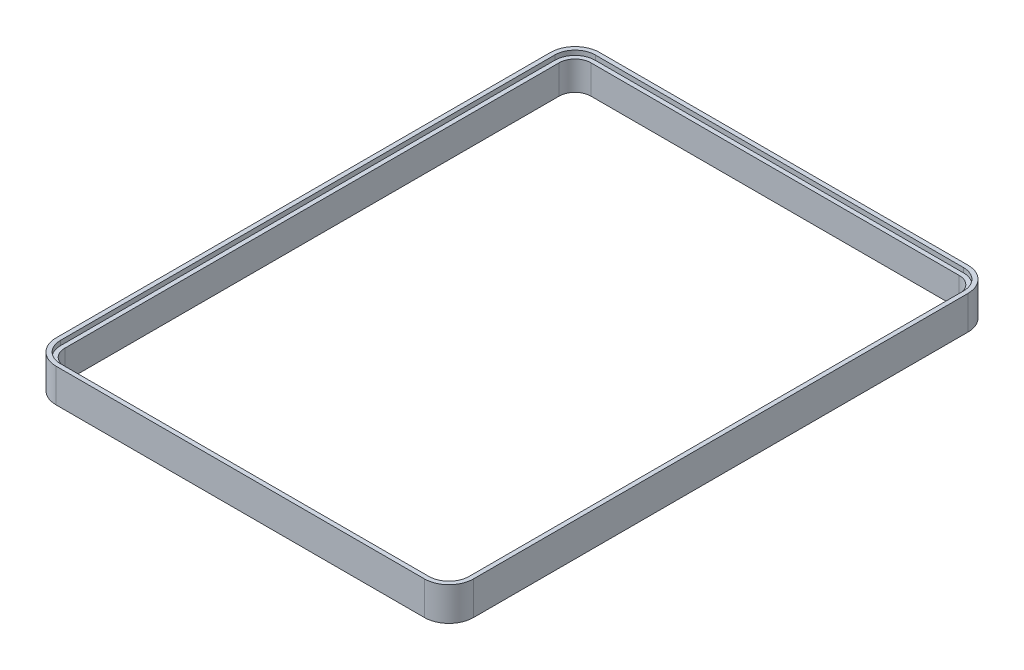
ISO-10303-21;
HEADER;
FILE_DESCRIPTION(('STEP AP214'),'2;1');
FILE_NAME('part.step','',(''),(''),'','','');
FILE_SCHEMA(('AUTOMOTIVE_DESIGN { 1 0 10303 214 1 1 1 1 }'));
ENDSEC;
DATA;
#1=APPLICATION_CONTEXT('core data for automotive mechanical design processes');
#2=APPLICATION_PROTOCOL_DEFINITION('international standard','automotive_design',2000,#1);
#3=PRODUCT_CONTEXT('',#1,'mechanical');
#4=PRODUCT('Part','Part','',(#3));
#5=PRODUCT_RELATED_PRODUCT_CATEGORY('part','',(#4));
#6=PRODUCT_DEFINITION_FORMATION('','',#4);
#7=PRODUCT_DEFINITION_CONTEXT('part definition',#1,'design');
#8=PRODUCT_DEFINITION('design','',#6,#7);
#9=PRODUCT_DEFINITION_SHAPE('','',#8);
#10=(LENGTH_UNIT() NAMED_UNIT(*) SI_UNIT(.MILLI.,.METRE.));
#11=(NAMED_UNIT(*) PLANE_ANGLE_UNIT() SI_UNIT($,.RADIAN.));
#12=(NAMED_UNIT(*) SI_UNIT($,.STERADIAN.) SOLID_ANGLE_UNIT());
#13=UNCERTAINTY_MEASURE_WITH_UNIT(LENGTH_MEASURE(1.E-05),#10,'distance_accuracy_value','');
#14=(GEOMETRIC_REPRESENTATION_CONTEXT(3) GLOBAL_UNCERTAINTY_ASSIGNED_CONTEXT((#13)) GLOBAL_UNIT_ASSIGNED_CONTEXT((#10,
#11,#12)) REPRESENTATION_CONTEXT('',''));
#15=CARTESIAN_POINT('',(0.,0.,0.));
#16=DIRECTION('',(0.,0.,1.));
#17=DIRECTION('',(1.,0.,0.));
#18=AXIS2_PLACEMENT_3D('',#15,#16,#17);
#19=CARTESIAN_POINT('',(31.85,-0.8,-42.75));
#20=DIRECTION('',(0.,1.,0.));
#21=DIRECTION('',(0.,0.,1.));
#22=AXIS2_PLACEMENT_3D('',#19,#20,#21);
#23=CYLINDRICAL_SURFACE('',#22,4.25000000000002);
#24=CARTESIAN_POINT('',(31.85,0.,-42.75));
#25=DIRECTION('',(0.,1.,0.));
#26=DIRECTION('',(0.,0.,1.));
#27=AXIS2_PLACEMENT_3D('',#24,#25,#26);
#28=CIRCLE('',#27,4.25000000000002);
#29=CARTESIAN_POINT('',(36.1,0.,-42.75));
#30=VERTEX_POINT('',#29);
#31=CARTESIAN_POINT('',(31.85,0.,-47.));
#32=VERTEX_POINT('',#31);
#33=EDGE_CURVE('E335',#30,#32,#28,.T.);
#34=ORIENTED_EDGE('',*,*,#33,.F.);
#35=DIRECTION('',(0.,1.,0.));
#36=VECTOR('',#35,1.);
#37=CARTESIAN_POINT('',(36.1,-0.8,-42.75));
#38=LINE('',#37,#36);
#39=CARTESIAN_POINT('',(36.1,-5.8,-42.75));
#40=VERTEX_POINT('',#39);
#41=EDGE_CURVE('E11',#40,#30,#38,.T.);
#42=ORIENTED_EDGE('',*,*,#41,.F.);
#43=CARTESIAN_POINT('',(31.85,-5.8,-42.75));
#44=DIRECTION('',(0.,-1.,0.));
#45=DIRECTION('',(0.,0.,-1.));
#46=AXIS2_PLACEMENT_3D('',#43,#44,#45);
#47=CIRCLE('',#46,4.25000000000002);
#48=CARTESIAN_POINT('',(31.85,-5.8,-47.));
#49=VERTEX_POINT('',#48);
#50=EDGE_CURVE('E282',#49,#40,#47,.T.);
#51=ORIENTED_EDGE('',*,*,#50,.F.);
#52=DIRECTION('',(0.,1.,0.));
#53=VECTOR('',#52,1.);
#54=CARTESIAN_POINT('',(31.85,-0.8,-47.));
#55=LINE('',#54,#53);
#56=EDGE_CURVE('E35',#49,#32,#55,.T.);
#57=ORIENTED_EDGE('',*,*,#56,.T.);
#58=EDGE_LOOP('',(#34,#42,#51,#57));
#59=FACE_BOUND('',#58,.T.);
#60=ADVANCED_FACE('F32',(#59),#23,.T.);
#61=CARTESIAN_POINT('',(36.1,-0.8,42.75));
#62=DIRECTION('',(1.,0.,0.));
#63=DIRECTION('',(0.,0.,-1.));
#64=AXIS2_PLACEMENT_3D('',#61,#62,#63);
#65=PLANE('',#64);
#66=DIRECTION('',(0.,0.,-1.));
#67=VECTOR('',#66,1.);
#68=CARTESIAN_POINT('',(36.1,0.,42.75));
#69=LINE('',#68,#67);
#70=CARTESIAN_POINT('',(36.1,0.,42.75));
#71=VERTEX_POINT('',#70);
#72=EDGE_CURVE('E369',#71,#30,#69,.T.);
#73=ORIENTED_EDGE('',*,*,#72,.F.);
#74=DIRECTION('',(0.,1.,0.));
#75=VECTOR('',#74,1.);
#76=CARTESIAN_POINT('',(36.1,-0.8,42.75));
#77=LINE('',#76,#75);
#78=CARTESIAN_POINT('',(36.1,-5.8,42.75));
#79=VERTEX_POINT('',#78);
#80=EDGE_CURVE('E40',#79,#71,#77,.T.);
#81=ORIENTED_EDGE('',*,*,#80,.F.);
#82=DIRECTION('',(0.,0.,1.));
#83=VECTOR('',#82,1.);
#84=CARTESIAN_POINT('',(36.1,-5.8,-42.75));
#85=LINE('',#84,#83);
#86=EDGE_CURVE('E285',#40,#79,#85,.T.);
#87=ORIENTED_EDGE('',*,*,#86,.F.);
#88=ORIENTED_EDGE('',*,*,#41,.T.);
#89=EDGE_LOOP('',(#73,#81,#87,#88));
#90=FACE_BOUND('',#89,.T.);
#91=ADVANCED_FACE('F394',(#90),#65,.T.);
#92=CARTESIAN_POINT('',(31.85,-0.8,42.75));
#93=DIRECTION('',(0.,1.,0.));
#94=DIRECTION('',(0.,0.,1.));
#95=AXIS2_PLACEMENT_3D('',#92,#93,#94);
#96=CYLINDRICAL_SURFACE('',#95,4.25000000000002);
#97=CARTESIAN_POINT('',(31.85,0.,42.75));
#98=DIRECTION('',(0.,1.,0.));
#99=DIRECTION('',(0.,0.,-1.));
#100=AXIS2_PLACEMENT_3D('',#97,#98,#99);
#101=CIRCLE('',#100,4.25000000000002);
#102=CARTESIAN_POINT('',(31.85,0.,47.));
#103=VERTEX_POINT('',#102);
#104=EDGE_CURVE('E366',#103,#71,#101,.T.);
#105=ORIENTED_EDGE('',*,*,#104,.F.);
#106=DIRECTION('',(0.,1.,0.));
#107=VECTOR('',#106,1.);
#108=CARTESIAN_POINT('',(31.85,-0.8,47.));
#109=LINE('',#108,#107);
#110=CARTESIAN_POINT('',(31.85,-5.8,47.));
#111=VERTEX_POINT('',#110);
#112=EDGE_CURVE('E373',#111,#103,#109,.T.);
#113=ORIENTED_EDGE('',*,*,#112,.F.);
#114=CARTESIAN_POINT('',(31.85,-5.8,42.75));
#115=DIRECTION('',(0.,-1.,0.));
#116=DIRECTION('',(0.,0.,-1.));
#117=AXIS2_PLACEMENT_3D('',#114,#115,#116);
#118=CIRCLE('',#117,4.25000000000001);
#119=EDGE_CURVE('E212',#79,#111,#118,.T.);
#120=ORIENTED_EDGE('',*,*,#119,.F.);
#121=ORIENTED_EDGE('',*,*,#80,.T.);
#122=EDGE_LOOP('',(#105,#113,#120,#121));
#123=FACE_BOUND('',#122,.T.);
#124=ADVANCED_FACE('F414',(#123),#96,.T.);
#125=CARTESIAN_POINT('',(31.85,-0.8,47.));
#126=DIRECTION('',(0.,0.,1.));
#127=DIRECTION('',(1.,0.,0.));
#128=AXIS2_PLACEMENT_3D('',#125,#126,#127);
#129=PLANE('',#128);
#130=DIRECTION('',(1.,0.,0.));
#131=VECTOR('',#130,1.);
#132=CARTESIAN_POINT('',(31.85,0.,47.));
#133=LINE('',#132,#131);
#134=CARTESIAN_POINT('',(-31.85,0.,47.));
#135=VERTEX_POINT('',#134);
#136=EDGE_CURVE('E363',#135,#103,#133,.T.);
#137=ORIENTED_EDGE('',*,*,#136,.F.);
#138=DIRECTION('',(0.,1.,0.));
#139=VECTOR('',#138,1.);
#140=CARTESIAN_POINT('',(-31.85,-0.8,47.));
#141=LINE('',#140,#139);
#142=CARTESIAN_POINT('',(-31.85,-5.8,47.));
#143=VERTEX_POINT('',#142);
#144=EDGE_CURVE('E375',#143,#135,#141,.T.);
#145=ORIENTED_EDGE('',*,*,#144,.F.);
#146=DIRECTION('',(-1.,0.,0.));
#147=VECTOR('',#146,1.);
#148=CARTESIAN_POINT('',(31.85,-5.8,47.));
#149=LINE('',#148,#147);
#150=EDGE_CURVE('E267',#111,#143,#149,.T.);
#151=ORIENTED_EDGE('',*,*,#150,.F.);
#152=ORIENTED_EDGE('',*,*,#112,.T.);
#153=EDGE_LOOP('',(#137,#145,#151,#152));
#154=FACE_BOUND('',#153,.T.);
#155=ADVANCED_FACE('F412',(#154),#129,.T.);
#156=CARTESIAN_POINT('',(-31.85,-0.8,42.75));
#157=DIRECTION('',(0.,1.,0.));
#158=DIRECTION('',(0.,0.,1.));
#159=AXIS2_PLACEMENT_3D('',#156,#157,#158);
#160=CYLINDRICAL_SURFACE('',#159,4.25000000000003);
#161=CARTESIAN_POINT('',(-31.85,0.,42.75));
#162=DIRECTION('',(0.,1.,0.));
#163=DIRECTION('',(0.,0.,1.));
#164=AXIS2_PLACEMENT_3D('',#161,#162,#163);
#165=CIRCLE('',#164,4.25000000000003);
#166=CARTESIAN_POINT('',(-36.1,0.,42.75));
#167=VERTEX_POINT('',#166);
#168=EDGE_CURVE('E360',#167,#135,#165,.T.);
#169=ORIENTED_EDGE('',*,*,#168,.F.);
#170=DIRECTION('',(0.,1.,0.));
#171=VECTOR('',#170,1.);
#172=CARTESIAN_POINT('',(-36.1,-0.8,42.75));
#173=LINE('',#172,#171);
#174=CARTESIAN_POINT('',(-36.1,-5.8,42.75));
#175=VERTEX_POINT('',#174);
#176=EDGE_CURVE('E377',#175,#167,#173,.T.);
#177=ORIENTED_EDGE('',*,*,#176,.F.);
#178=CARTESIAN_POINT('',(-31.85,-5.8,42.75));
#179=DIRECTION('',(0.,-1.,0.));
#180=DIRECTION('',(0.,0.,-1.));
#181=AXIS2_PLACEMENT_3D('',#178,#179,#180);
#182=CIRCLE('',#181,4.25000000000003);
#183=EDGE_CURVE('E270',#143,#175,#182,.T.);
#184=ORIENTED_EDGE('',*,*,#183,.F.);
#185=ORIENTED_EDGE('',*,*,#144,.T.);
#186=EDGE_LOOP('',(#169,#177,#184,#185));
#187=FACE_BOUND('',#186,.T.);
#188=ADVANCED_FACE('F408',(#187),#160,.T.);
#189=CARTESIAN_POINT('',(-36.1,-0.8,42.75));
#190=DIRECTION('',(-1.,0.,0.));
#191=DIRECTION('',(0.,0.,1.));
#192=AXIS2_PLACEMENT_3D('',#189,#190,#191);
#193=PLANE('',#192);
#194=DIRECTION('',(0.,0.,1.));
#195=VECTOR('',#194,1.);
#196=CARTESIAN_POINT('',(-36.1,0.,42.75));
#197=LINE('',#196,#195);
#198=CARTESIAN_POINT('',(-36.1,0.,-42.75));
#199=VERTEX_POINT('',#198);
#200=EDGE_CURVE('E357',#199,#167,#197,.T.);
#201=ORIENTED_EDGE('',*,*,#200,.F.);
#202=DIRECTION('',(0.,1.,0.));
#203=VECTOR('',#202,1.);
#204=CARTESIAN_POINT('',(-36.1,-0.8,-42.75));
#205=LINE('',#204,#203);
#206=CARTESIAN_POINT('',(-36.1,-5.8,-42.75));
#207=VERTEX_POINT('',#206);
#208=EDGE_CURVE('E379',#207,#199,#205,.T.);
#209=ORIENTED_EDGE('',*,*,#208,.F.);
#210=DIRECTION('',(0.,0.,-1.));
#211=VECTOR('',#210,1.);
#212=CARTESIAN_POINT('',(-36.1,-5.8,42.75));
#213=LINE('',#212,#211);
#214=EDGE_CURVE('E273',#175,#207,#213,.T.);
#215=ORIENTED_EDGE('',*,*,#214,.F.);
#216=ORIENTED_EDGE('',*,*,#176,.T.);
#217=EDGE_LOOP('',(#201,#209,#215,#216));
#218=FACE_BOUND('',#217,.T.);
#219=ADVANCED_FACE('F405',(#218),#193,.T.);
#220=CARTESIAN_POINT('',(-31.85,-0.8,-42.75));
#221=DIRECTION('',(0.,1.,0.));
#222=DIRECTION('',(0.,0.,1.));
#223=AXIS2_PLACEMENT_3D('',#220,#221,#222);
#224=CYLINDRICAL_SURFACE('',#223,4.25000000000002);
#225=CARTESIAN_POINT('',(-31.85,0.,-42.75));
#226=DIRECTION('',(0.,1.,0.));
#227=DIRECTION('',(0.,0.,-1.));
#228=AXIS2_PLACEMENT_3D('',#225,#226,#227);
#229=CIRCLE('',#228,4.25000000000002);
#230=CARTESIAN_POINT('',(-31.85,0.,-47.));
#231=VERTEX_POINT('',#230);
#232=EDGE_CURVE('E354',#231,#199,#229,.T.);
#233=ORIENTED_EDGE('',*,*,#232,.F.);
#234=DIRECTION('',(0.,1.,0.));
#235=VECTOR('',#234,1.);
#236=CARTESIAN_POINT('',(-31.85,-0.8,-47.));
#237=LINE('',#236,#235);
#238=CARTESIAN_POINT('',(-31.85,-5.8,-47.));
#239=VERTEX_POINT('',#238);
#240=EDGE_CURVE('E380',#239,#231,#237,.T.);
#241=ORIENTED_EDGE('',*,*,#240,.F.);
#242=CARTESIAN_POINT('',(-31.85,-5.8,-42.75));
#243=DIRECTION('',(0.,-1.,0.));
#244=DIRECTION('',(0.,0.,-1.));
#245=AXIS2_PLACEMENT_3D('',#242,#243,#244);
#246=CIRCLE('',#245,4.25000000000001);
#247=EDGE_CURVE('E276',#207,#239,#246,.T.);
#248=ORIENTED_EDGE('',*,*,#247,.F.);
#249=ORIENTED_EDGE('',*,*,#208,.T.);
#250=EDGE_LOOP('',(#233,#241,#248,#249));
#251=FACE_BOUND('',#250,.T.);
#252=ADVANCED_FACE('F401',(#251),#224,.T.);
#253=CARTESIAN_POINT('',(31.85,-0.8,-47.));
#254=DIRECTION('',(0.,0.,-1.));
#255=DIRECTION('',(-1.,0.,0.));
#256=AXIS2_PLACEMENT_3D('',#253,#254,#255);
#257=PLANE('',#256);
#258=DIRECTION('',(-1.,0.,0.));
#259=VECTOR('',#258,1.);
#260=CARTESIAN_POINT('',(31.85,0.,-47.));
#261=LINE('',#260,#259);
#262=EDGE_CURVE('E351',#32,#231,#261,.T.);
#263=ORIENTED_EDGE('',*,*,#262,.F.);
#264=ORIENTED_EDGE('',*,*,#56,.F.);
#265=DIRECTION('',(1.,0.,0.));
#266=VECTOR('',#265,1.);
#267=CARTESIAN_POINT('',(-31.85,-5.8,-47.));
#268=LINE('',#267,#266);
#269=EDGE_CURVE('E279',#239,#49,#268,.T.);
#270=ORIENTED_EDGE('',*,*,#269,.F.);
#271=ORIENTED_EDGE('',*,*,#240,.T.);
#272=EDGE_LOOP('',(#263,#264,#270,#271));
#273=FACE_BOUND('',#272,.T.);
#274=ADVANCED_FACE('F388',(#273),#257,.T.);
#275=CARTESIAN_POINT('',(31.85,0.,-42.75));
#276=DIRECTION('',(0.,1.,0.));
#277=DIRECTION('',(0.,0.,1.));
#278=AXIS2_PLACEMENT_3D('',#275,#276,#277);
#279=PLANE('',#278);
#280=CARTESIAN_POINT('',(31.85,0.,-42.75));
#281=DIRECTION('',(0.,1.,0.));
#282=DIRECTION('',(0.,0.,1.));
#283=AXIS2_PLACEMENT_3D('',#280,#281,#282);
#284=CIRCLE('',#283,3.50000000000002);
#285=CARTESIAN_POINT('',(35.35,0.,-42.75));
#286=VERTEX_POINT('',#285);
#287=CARTESIAN_POINT('',(31.85,0.,-46.25));
#288=VERTEX_POINT('',#287);
#289=EDGE_CURVE('E56',#286,#288,#284,.T.);
#290=ORIENTED_EDGE('',*,*,#289,.F.);
#291=DIRECTION('',(0.,0.,-1.));
#292=VECTOR('',#291,1.);
#293=CARTESIAN_POINT('',(35.35,0.,42.75));
#294=LINE('',#293,#292);
#295=CARTESIAN_POINT('',(35.35,0.,42.75));
#296=VERTEX_POINT('',#295);
#297=EDGE_CURVE('E292',#296,#286,#294,.T.);
#298=ORIENTED_EDGE('',*,*,#297,.F.);
#299=CARTESIAN_POINT('',(31.85,0.,42.75));
#300=DIRECTION('',(0.,1.,0.));
#301=DIRECTION('',(0.,0.,-1.));
#302=AXIS2_PLACEMENT_3D('',#299,#300,#301);
#303=CIRCLE('',#302,3.50000000000002);
#304=CARTESIAN_POINT('',(31.85,0.,46.25));
#305=VERTEX_POINT('',#304);
#306=EDGE_CURVE('E328',#305,#296,#303,.T.);
#307=ORIENTED_EDGE('',*,*,#306,.F.);
#308=DIRECTION('',(1.,0.,0.));
#309=VECTOR('',#308,1.);
#310=CARTESIAN_POINT('',(31.85,0.,46.25));
#311=LINE('',#310,#309);
#312=CARTESIAN_POINT('',(-31.85,0.,46.25));
#313=VERTEX_POINT('',#312);
#314=EDGE_CURVE('E325',#313,#305,#311,.T.);
#315=ORIENTED_EDGE('',*,*,#314,.F.);
#316=CARTESIAN_POINT('',(-31.85,0.,42.75));
#317=DIRECTION('',(0.,1.,0.));
#318=DIRECTION('',(0.,0.,1.));
#319=AXIS2_PLACEMENT_3D('',#316,#317,#318);
#320=CIRCLE('',#319,3.50000000000002);
#321=CARTESIAN_POINT('',(-35.35,0.,42.75));
#322=VERTEX_POINT('',#321);
#323=EDGE_CURVE('E322',#322,#313,#320,.T.);
#324=ORIENTED_EDGE('',*,*,#323,.F.);
#325=DIRECTION('',(0.,0.,1.));
#326=VECTOR('',#325,1.);
#327=CARTESIAN_POINT('',(-35.35,0.,42.75));
#328=LINE('',#327,#326);
#329=CARTESIAN_POINT('',(-35.35,0.,-42.75));
#330=VERTEX_POINT('',#329);
#331=EDGE_CURVE('E319',#330,#322,#328,.T.);
#332=ORIENTED_EDGE('',*,*,#331,.F.);
#333=CARTESIAN_POINT('',(-31.85,0.,-42.75));
#334=DIRECTION('',(0.,1.,0.));
#335=DIRECTION('',(0.,0.,-1.));
#336=AXIS2_PLACEMENT_3D('',#333,#334,#335);
#337=CIRCLE('',#336,3.50000000000002);
#338=CARTESIAN_POINT('',(-31.85,0.,-46.25));
#339=VERTEX_POINT('',#338);
#340=EDGE_CURVE('E316',#339,#330,#337,.T.);
#341=ORIENTED_EDGE('',*,*,#340,.F.);
#342=DIRECTION('',(-1.,0.,0.));
#343=VECTOR('',#342,1.);
#344=CARTESIAN_POINT('',(31.85,0.,-46.25));
#345=LINE('',#344,#343);
#346=EDGE_CURVE('E313',#288,#339,#345,.T.);
#347=ORIENTED_EDGE('',*,*,#346,.F.);
#348=EDGE_LOOP('',(#290,#298,#307,#315,#324,#332,#341,#347));
#349=FACE_BOUND('',#348,.T.);
#350=ORIENTED_EDGE('',*,*,#33,.T.);
#351=ORIENTED_EDGE('',*,*,#262,.T.);
#352=ORIENTED_EDGE('',*,*,#232,.T.);
#353=ORIENTED_EDGE('',*,*,#200,.T.);
#354=ORIENTED_EDGE('',*,*,#168,.T.);
#355=ORIENTED_EDGE('',*,*,#136,.T.);
#356=ORIENTED_EDGE('',*,*,#104,.T.);
#357=ORIENTED_EDGE('',*,*,#72,.T.);
#358=EDGE_LOOP('',(#350,#351,#352,#353,#354,#355,#356,#357));
#359=FACE_BOUND('',#358,.T.);
#360=ADVANCED_FACE('F390',(#349,#359),#279,.T.);
#361=CARTESIAN_POINT('',(31.85,-0.8,-42.75));
#362=DIRECTION('',(0.,1.,0.));
#363=DIRECTION('',(0.,0.,1.));
#364=AXIS2_PLACEMENT_3D('',#361,#362,#363);
#365=CYLINDRICAL_SURFACE('',#364,3.50000000000002);
#366=ORIENTED_EDGE('',*,*,#289,.T.);
#367=DIRECTION('',(0.,1.,0.));
#368=VECTOR('',#367,1.);
#369=CARTESIAN_POINT('',(31.85,-0.8,-46.25));
#370=LINE('',#369,#368);
#371=CARTESIAN_POINT('',(31.85,-0.8,-46.25));
#372=VERTEX_POINT('',#371);
#373=EDGE_CURVE('E311',#372,#288,#370,.T.);
#374=ORIENTED_EDGE('',*,*,#373,.F.);
#375=CARTESIAN_POINT('',(31.85,-0.8,-42.75));
#376=DIRECTION('',(0.,1.,0.));
#377=DIRECTION('',(0.,0.,1.));
#378=AXIS2_PLACEMENT_3D('',#375,#376,#377);
#379=CIRCLE('',#378,3.50000000000002);
#380=CARTESIAN_POINT('',(35.35,-0.8,-42.75));
#381=VERTEX_POINT('',#380);
#382=EDGE_CURVE('E288',#381,#372,#379,.T.);
#383=ORIENTED_EDGE('',*,*,#382,.F.);
#384=DIRECTION('',(0.,1.,0.));
#385=VECTOR('',#384,1.);
#386=CARTESIAN_POINT('',(35.35,-0.8,-42.75));
#387=LINE('',#386,#385);
#388=EDGE_CURVE('E333',#381,#286,#387,.T.);
#389=ORIENTED_EDGE('',*,*,#388,.T.);
#390=EDGE_LOOP('',(#366,#374,#383,#389));
#391=FACE_BOUND('',#390,.T.);
#392=ADVANCED_FACE('F486',(#391),#365,.F.);
#393=CARTESIAN_POINT('',(35.35,-0.8,42.75));
#394=DIRECTION('',(1.,0.,0.));
#395=DIRECTION('',(0.,0.,-1.));
#396=AXIS2_PLACEMENT_3D('',#393,#394,#395);
#397=PLANE('',#396);
#398=ORIENTED_EDGE('',*,*,#297,.T.);
#399=ORIENTED_EDGE('',*,*,#388,.F.);
#400=DIRECTION('',(0.,0.,-1.));
#401=VECTOR('',#400,1.);
#402=CARTESIAN_POINT('',(35.35,-0.8,42.75));
#403=LINE('',#402,#401);
#404=CARTESIAN_POINT('',(35.35,-0.8,42.75));
#405=VERTEX_POINT('',#404);
#406=EDGE_CURVE('E308',#405,#381,#403,.T.);
#407=ORIENTED_EDGE('',*,*,#406,.F.);
#408=DIRECTION('',(0.,1.,0.));
#409=VECTOR('',#408,1.);
#410=CARTESIAN_POINT('',(35.35,-0.8,42.75));
#411=LINE('',#410,#409);
#412=EDGE_CURVE('E336',#405,#296,#411,.T.);
#413=ORIENTED_EDGE('',*,*,#412,.T.);
#414=EDGE_LOOP('',(#398,#399,#407,#413));
#415=FACE_BOUND('',#414,.T.);
#416=ADVANCED_FACE('F491',(#415),#397,.F.);
#417=CARTESIAN_POINT('',(31.85,-0.8,42.75));
#418=DIRECTION('',(0.,1.,0.));
#419=DIRECTION('',(0.,0.,1.));
#420=AXIS2_PLACEMENT_3D('',#417,#418,#419);
#421=CYLINDRICAL_SURFACE('',#420,3.50000000000002);
#422=ORIENTED_EDGE('',*,*,#306,.T.);
#423=ORIENTED_EDGE('',*,*,#412,.F.);
#424=CARTESIAN_POINT('',(31.85,-0.8,42.75));
#425=DIRECTION('',(0.,1.,0.));
#426=DIRECTION('',(0.,0.,-1.));
#427=AXIS2_PLACEMENT_3D('',#424,#425,#426);
#428=CIRCLE('',#427,3.50000000000002);
#429=CARTESIAN_POINT('',(31.85,-0.8,46.25));
#430=VERTEX_POINT('',#429);
#431=EDGE_CURVE('E305',#430,#405,#428,.T.);
#432=ORIENTED_EDGE('',*,*,#431,.F.);
#433=DIRECTION('',(0.,1.,0.));
#434=VECTOR('',#433,1.);
#435=CARTESIAN_POINT('',(31.85,-0.8,46.25));
#436=LINE('',#435,#434);
#437=EDGE_CURVE('E338',#430,#305,#436,.T.);
#438=ORIENTED_EDGE('',*,*,#437,.T.);
#439=EDGE_LOOP('',(#422,#423,#432,#438));
#440=FACE_BOUND('',#439,.T.);
#441=ADVANCED_FACE('F501',(#440),#421,.F.);
#442=CARTESIAN_POINT('',(31.85,-0.8,46.25));
#443=DIRECTION('',(0.,0.,1.));
#444=DIRECTION('',(1.,0.,0.));
#445=AXIS2_PLACEMENT_3D('',#442,#443,#444);
#446=PLANE('',#445);
#447=ORIENTED_EDGE('',*,*,#314,.T.);
#448=ORIENTED_EDGE('',*,*,#437,.F.);
#449=DIRECTION('',(1.,0.,0.));
#450=VECTOR('',#449,1.);
#451=CARTESIAN_POINT('',(31.85,-0.8,46.25));
#452=LINE('',#451,#450);
#453=CARTESIAN_POINT('',(-31.85,-0.8,46.25));
#454=VERTEX_POINT('',#453);
#455=EDGE_CURVE('E302',#454,#430,#452,.T.);
#456=ORIENTED_EDGE('',*,*,#455,.F.);
#457=DIRECTION('',(0.,1.,0.));
#458=VECTOR('',#457,1.);
#459=CARTESIAN_POINT('',(-31.85,-0.8,46.25));
#460=LINE('',#459,#458);
#461=EDGE_CURVE('E340',#454,#313,#460,.T.);
#462=ORIENTED_EDGE('',*,*,#461,.T.);
#463=EDGE_LOOP('',(#447,#448,#456,#462));
#464=FACE_BOUND('',#463,.T.);
#465=ADVANCED_FACE('F511',(#464),#446,.F.);
#466=CARTESIAN_POINT('',(-31.85,-0.8,42.75));
#467=DIRECTION('',(0.,1.,0.));
#468=DIRECTION('',(0.,0.,1.));
#469=AXIS2_PLACEMENT_3D('',#466,#467,#468);
#470=CYLINDRICAL_SURFACE('',#469,3.50000000000002);
#471=ORIENTED_EDGE('',*,*,#323,.T.);
#472=ORIENTED_EDGE('',*,*,#461,.F.);
#473=CARTESIAN_POINT('',(-31.85,-0.8,42.75));
#474=DIRECTION('',(0.,1.,0.));
#475=DIRECTION('',(0.,0.,1.));
#476=AXIS2_PLACEMENT_3D('',#473,#474,#475);
#477=CIRCLE('',#476,3.50000000000002);
#478=CARTESIAN_POINT('',(-35.35,-0.8,42.75));
#479=VERTEX_POINT('',#478);
#480=EDGE_CURVE('E299',#479,#454,#477,.T.);
#481=ORIENTED_EDGE('',*,*,#480,.F.);
#482=DIRECTION('',(0.,1.,0.));
#483=VECTOR('',#482,1.);
#484=CARTESIAN_POINT('',(-35.35,-0.8,42.75));
#485=LINE('',#484,#483);
#486=EDGE_CURVE('E342',#479,#322,#485,.T.);
#487=ORIENTED_EDGE('',*,*,#486,.T.);
#488=EDGE_LOOP('',(#471,#472,#481,#487));
#489=FACE_BOUND('',#488,.T.);
#490=ADVANCED_FACE('F521',(#489),#470,.F.);
#491=CARTESIAN_POINT('',(-35.35,-0.8,42.75));
#492=DIRECTION('',(-1.,0.,0.));
#493=DIRECTION('',(0.,0.,1.));
#494=AXIS2_PLACEMENT_3D('',#491,#492,#493);
#495=PLANE('',#494);
#496=ORIENTED_EDGE('',*,*,#331,.T.);
#497=ORIENTED_EDGE('',*,*,#486,.F.);
#498=DIRECTION('',(0.,0.,1.));
#499=VECTOR('',#498,1.);
#500=CARTESIAN_POINT('',(-35.35,-0.8,42.75));
#501=LINE('',#500,#499);
#502=CARTESIAN_POINT('',(-35.35,-0.8,-42.75));
#503=VERTEX_POINT('',#502);
#504=EDGE_CURVE('E296',#503,#479,#501,.T.);
#505=ORIENTED_EDGE('',*,*,#504,.F.);
#506=DIRECTION('',(0.,1.,0.));
#507=VECTOR('',#506,1.);
#508=CARTESIAN_POINT('',(-35.35,-0.8,-42.75));
#509=LINE('',#508,#507);
#510=EDGE_CURVE('E344',#503,#330,#509,.T.);
#511=ORIENTED_EDGE('',*,*,#510,.T.);
#512=EDGE_LOOP('',(#496,#497,#505,#511));
#513=FACE_BOUND('',#512,.T.);
#514=ADVANCED_FACE('F531',(#513),#495,.F.);
#515=CARTESIAN_POINT('',(-31.85,-0.8,-42.75));
#516=DIRECTION('',(0.,1.,0.));
#517=DIRECTION('',(0.,0.,1.));
#518=AXIS2_PLACEMENT_3D('',#515,#516,#517);
#519=CYLINDRICAL_SURFACE('',#518,3.50000000000002);
#520=ORIENTED_EDGE('',*,*,#340,.T.);
#521=ORIENTED_EDGE('',*,*,#510,.F.);
#522=CARTESIAN_POINT('',(-31.85,-0.8,-42.75));
#523=DIRECTION('',(0.,1.,0.));
#524=DIRECTION('',(0.,0.,-1.));
#525=AXIS2_PLACEMENT_3D('',#522,#523,#524);
#526=CIRCLE('',#525,3.50000000000002);
#527=CARTESIAN_POINT('',(-31.85,-0.8,-46.25));
#528=VERTEX_POINT('',#527);
#529=EDGE_CURVE('E48',#528,#503,#526,.T.);
#530=ORIENTED_EDGE('',*,*,#529,.F.);
#531=DIRECTION('',(0.,1.,0.));
#532=VECTOR('',#531,1.);
#533=CARTESIAN_POINT('',(-31.85,-0.8,-46.25));
#534=LINE('',#533,#532);
#535=EDGE_CURVE('E346',#528,#339,#534,.T.);
#536=ORIENTED_EDGE('',*,*,#535,.T.);
#537=EDGE_LOOP('',(#520,#521,#530,#536));
#538=FACE_BOUND('',#537,.T.);
#539=ADVANCED_FACE('F541',(#538),#519,.F.);
#540=CARTESIAN_POINT('',(31.85,-0.8,-46.25));
#541=DIRECTION('',(0.,0.,-1.));
#542=DIRECTION('',(-1.,0.,0.));
#543=AXIS2_PLACEMENT_3D('',#540,#541,#542);
#544=PLANE('',#543);
#545=ORIENTED_EDGE('',*,*,#346,.T.);
#546=ORIENTED_EDGE('',*,*,#535,.F.);
#547=DIRECTION('',(-1.,0.,0.));
#548=VECTOR('',#547,1.);
#549=CARTESIAN_POINT('',(31.85,-0.8,-46.25));
#550=LINE('',#549,#548);
#551=EDGE_CURVE('E291',#372,#528,#550,.T.);
#552=ORIENTED_EDGE('',*,*,#551,.F.);
#553=ORIENTED_EDGE('',*,*,#373,.T.);
#554=EDGE_LOOP('',(#545,#546,#552,#553));
#555=FACE_BOUND('',#554,.T.);
#556=ADVANCED_FACE('F551',(#555),#544,.F.);
#557=CARTESIAN_POINT('',(31.85,-0.8,42.75));
#558=DIRECTION('',(0.,-1.,0.));
#559=DIRECTION('',(0.,0.,-1.));
#560=AXIS2_PLACEMENT_3D('',#557,#558,#559);
#561=PLANE('',#560);
#562=CARTESIAN_POINT('',(-31.85,-0.8,42.75));
#563=DIRECTION('',(0.,-1.,0.));
#564=DIRECTION('',(0.,0.,-1.));
#565=AXIS2_PLACEMENT_3D('',#562,#563,#564);
#566=CIRCLE('',#565,2.75000000000004);
#567=CARTESIAN_POINT('',(-31.85,-0.8,45.5));
#568=VERTEX_POINT('',#567);
#569=CARTESIAN_POINT('',(-34.6,-0.8,42.75));
#570=VERTEX_POINT('',#569);
#571=EDGE_CURVE('E233',#568,#570,#566,.T.);
#572=ORIENTED_EDGE('',*,*,#571,.T.);
#573=DIRECTION('',(0.,0.,-1.));
#574=VECTOR('',#573,1.);
#575=CARTESIAN_POINT('',(-34.6,-0.8,42.75));
#576=LINE('',#575,#574);
#577=CARTESIAN_POINT('',(-34.6,-0.8,-42.75));
#578=VERTEX_POINT('',#577);
#579=EDGE_CURVE('E211',#570,#578,#576,.T.);
#580=ORIENTED_EDGE('',*,*,#579,.T.);
#581=CARTESIAN_POINT('',(-31.85,-0.8,-42.75));
#582=DIRECTION('',(0.,-1.,0.));
#583=DIRECTION('',(0.,0.,-1.));
#584=AXIS2_PLACEMENT_3D('',#581,#582,#583);
#585=CIRCLE('',#584,2.75000000000003);
#586=CARTESIAN_POINT('',(-31.85,-0.8,-45.5));
#587=VERTEX_POINT('',#586);
#588=EDGE_CURVE('E236',#578,#587,#585,.T.);
#589=ORIENTED_EDGE('',*,*,#588,.T.);
#590=DIRECTION('',(1.,0.,0.));
#591=VECTOR('',#590,1.);
#592=CARTESIAN_POINT('',(-31.85,-0.8,-45.5));
#593=LINE('',#592,#591);
#594=CARTESIAN_POINT('',(31.85,-0.8,-45.5));
#595=VERTEX_POINT('',#594);
#596=EDGE_CURVE('E239',#587,#595,#593,.T.);
#597=ORIENTED_EDGE('',*,*,#596,.T.);
#598=CARTESIAN_POINT('',(31.85,-0.8,-42.75));
#599=DIRECTION('',(0.,-1.,0.));
#600=DIRECTION('',(0.,0.,-1.));
#601=AXIS2_PLACEMENT_3D('',#598,#599,#600);
#602=CIRCLE('',#601,2.75000000000002);
#603=CARTESIAN_POINT('',(34.6,-0.8,-42.75));
#604=VERTEX_POINT('',#603);
#605=EDGE_CURVE('E242',#595,#604,#602,.T.);
#606=ORIENTED_EDGE('',*,*,#605,.T.);
#607=DIRECTION('',(0.,0.,1.));
#608=VECTOR('',#607,1.);
#609=CARTESIAN_POINT('',(34.6,-0.8,-42.75));
#610=LINE('',#609,#608);
#611=CARTESIAN_POINT('',(34.6,-0.8,42.75));
#612=VERTEX_POINT('',#611);
#613=EDGE_CURVE('E245',#604,#612,#610,.T.);
#614=ORIENTED_EDGE('',*,*,#613,.T.);
#615=CARTESIAN_POINT('',(31.85,-0.8,42.75));
#616=DIRECTION('',(0.,-1.,0.));
#617=DIRECTION('',(0.,0.,-1.));
#618=AXIS2_PLACEMENT_3D('',#615,#616,#617);
#619=CIRCLE('',#618,2.75000000000003);
#620=CARTESIAN_POINT('',(31.85,-0.8,45.5));
#621=VERTEX_POINT('',#620);
#622=EDGE_CURVE('E248',#612,#621,#619,.T.);
#623=ORIENTED_EDGE('',*,*,#622,.T.);
#624=DIRECTION('',(-1.,0.,0.));
#625=VECTOR('',#624,1.);
#626=CARTESIAN_POINT('',(31.85,-0.8,45.5));
#627=LINE('',#626,#625);
#628=EDGE_CURVE('E205',#621,#568,#627,.T.);
#629=ORIENTED_EDGE('',*,*,#628,.T.);
#630=EDGE_LOOP('',(#572,#580,#589,#597,#606,#614,#623,#629));
#631=FACE_BOUND('',#630,.T.);
#632=ORIENTED_EDGE('',*,*,#431,.T.);
#633=ORIENTED_EDGE('',*,*,#406,.T.);
#634=ORIENTED_EDGE('',*,*,#382,.T.);
#635=ORIENTED_EDGE('',*,*,#551,.T.);
#636=ORIENTED_EDGE('',*,*,#529,.T.);
#637=ORIENTED_EDGE('',*,*,#504,.T.);
#638=ORIENTED_EDGE('',*,*,#480,.T.);
#639=ORIENTED_EDGE('',*,*,#455,.T.);
#640=EDGE_LOOP('',(#632,#633,#634,#635,#636,#637,#638,#639));
#641=FACE_BOUND('',#640,.T.);
#642=ADVANCED_FACE('F560',(#631,#641),#561,.F.);
#643=CARTESIAN_POINT('',(31.85,-5.8,42.75));
#644=DIRECTION('',(0.,-1.,0.));
#645=DIRECTION('',(0.,0.,-1.));
#646=AXIS2_PLACEMENT_3D('',#643,#644,#645);
#647=PLANE('',#646);
#648=ORIENTED_EDGE('',*,*,#119,.T.);
#649=ORIENTED_EDGE('',*,*,#150,.T.);
#650=ORIENTED_EDGE('',*,*,#183,.T.);
#651=ORIENTED_EDGE('',*,*,#214,.T.);
#652=ORIENTED_EDGE('',*,*,#247,.T.);
#653=ORIENTED_EDGE('',*,*,#269,.T.);
#654=ORIENTED_EDGE('',*,*,#50,.T.);
#655=ORIENTED_EDGE('',*,*,#86,.T.);
#656=EDGE_LOOP('',(#648,#649,#650,#651,#652,#653,#654,#655));
#657=FACE_BOUND('',#656,.T.);
#658=DIRECTION('',(0.,0.,-1.));
#659=VECTOR('',#658,1.);
#660=CARTESIAN_POINT('',(-34.6,-5.8,42.75));
#661=LINE('',#660,#659);
#662=CARTESIAN_POINT('',(-34.6,-5.8,42.75));
#663=VERTEX_POINT('',#662);
#664=CARTESIAN_POINT('',(-34.6,-5.8,-42.75));
#665=VERTEX_POINT('',#664);
#666=EDGE_CURVE('E204',#663,#665,#661,.T.);
#667=ORIENTED_EDGE('',*,*,#666,.F.);
#668=CARTESIAN_POINT('',(-31.85,-5.8,42.75));
#669=DIRECTION('',(0.,-1.,0.));
#670=DIRECTION('',(0.,0.,-1.));
#671=AXIS2_PLACEMENT_3D('',#668,#669,#670);
#672=CIRCLE('',#671,2.75000000000004);
#673=CARTESIAN_POINT('',(-31.85,-5.8,45.5));
#674=VERTEX_POINT('',#673);
#675=EDGE_CURVE('E194',#674,#663,#672,.T.);
#676=ORIENTED_EDGE('',*,*,#675,.F.);
#677=DIRECTION('',(-1.,0.,0.));
#678=VECTOR('',#677,1.);
#679=CARTESIAN_POINT('',(31.85,-5.8,45.5));
#680=LINE('',#679,#678);
#681=CARTESIAN_POINT('',(31.85,-5.8,45.5));
#682=VERTEX_POINT('',#681);
#683=EDGE_CURVE('E231',#682,#674,#680,.T.);
#684=ORIENTED_EDGE('',*,*,#683,.F.);
#685=CARTESIAN_POINT('',(31.85,-5.8,42.75));
#686=DIRECTION('',(0.,-1.,0.));
#687=DIRECTION('',(0.,0.,-1.));
#688=AXIS2_PLACEMENT_3D('',#685,#686,#687);
#689=CIRCLE('',#688,2.75000000000003);
#690=CARTESIAN_POINT('',(34.6,-5.8,42.75));
#691=VERTEX_POINT('',#690);
#692=EDGE_CURVE('E228',#691,#682,#689,.T.);
#693=ORIENTED_EDGE('',*,*,#692,.F.);
#694=DIRECTION('',(0.,0.,1.));
#695=VECTOR('',#694,1.);
#696=CARTESIAN_POINT('',(34.6,-5.8,-42.75));
#697=LINE('',#696,#695);
#698=CARTESIAN_POINT('',(34.6,-5.8,-42.75));
#699=VERTEX_POINT('',#698);
#700=EDGE_CURVE('E226',#699,#691,#697,.T.);
#701=ORIENTED_EDGE('',*,*,#700,.F.);
#702=CARTESIAN_POINT('',(31.85,-5.8,-42.75));
#703=DIRECTION('',(0.,-1.,0.));
#704=DIRECTION('',(0.,0.,-1.));
#705=AXIS2_PLACEMENT_3D('',#702,#703,#704);
#706=CIRCLE('',#705,2.75000000000002);
#707=CARTESIAN_POINT('',(31.85,-5.8,-45.5));
#708=VERTEX_POINT('',#707);
#709=EDGE_CURVE('E224',#708,#699,#706,.T.);
#710=ORIENTED_EDGE('',*,*,#709,.F.);
#711=DIRECTION('',(1.,0.,0.));
#712=VECTOR('',#711,1.);
#713=CARTESIAN_POINT('',(-31.85,-5.8,-45.5));
#714=LINE('',#713,#712);
#715=CARTESIAN_POINT('',(-31.85,-5.8,-45.5));
#716=VERTEX_POINT('',#715);
#717=EDGE_CURVE('E220',#716,#708,#714,.T.);
#718=ORIENTED_EDGE('',*,*,#717,.F.);
#719=CARTESIAN_POINT('',(-31.85,-5.8,-42.75));
#720=DIRECTION('',(0.,-1.,0.));
#721=DIRECTION('',(0.,0.,-1.));
#722=AXIS2_PLACEMENT_3D('',#719,#720,#721);
#723=CIRCLE('',#722,2.75000000000003);
#724=EDGE_CURVE('E218',#665,#716,#723,.T.);
#725=ORIENTED_EDGE('',*,*,#724,.F.);
#726=EDGE_LOOP('',(#667,#676,#684,#693,#701,#710,#718,#725));
#727=FACE_BOUND('',#726,.T.);
#728=ADVANCED_FACE('F216',(#657,#727),#647,.T.);
#729=CARTESIAN_POINT('',(-31.85,-5.8,42.75));
#730=DIRECTION('',(0.,1.,0.));
#731=DIRECTION('',(0.,0.,1.));
#732=AXIS2_PLACEMENT_3D('',#729,#730,#731);
#733=CYLINDRICAL_SURFACE('',#732,2.75000000000004);
#734=ORIENTED_EDGE('',*,*,#571,.F.);
#735=DIRECTION('',(0.,1.,0.));
#736=VECTOR('',#735,1.);
#737=CARTESIAN_POINT('',(-31.85,-5.8,45.5));
#738=LINE('',#737,#736);
#739=EDGE_CURVE('E200',#674,#568,#738,.T.);
#740=ORIENTED_EDGE('',*,*,#739,.F.);
#741=ORIENTED_EDGE('',*,*,#675,.T.);
#742=DIRECTION('',(0.,1.,0.));
#743=VECTOR('',#742,1.);
#744=CARTESIAN_POINT('',(-34.6,-5.8,42.75));
#745=LINE('',#744,#743);
#746=EDGE_CURVE('E197',#663,#570,#745,.T.);
#747=ORIENTED_EDGE('',*,*,#746,.T.);
#748=EDGE_LOOP('',(#734,#740,#741,#747));
#749=FACE_BOUND('',#748,.T.);
#750=ADVANCED_FACE('F196',(#749),#733,.F.);
#751=CARTESIAN_POINT('',(-34.6,-5.8,42.75));
#752=DIRECTION('',(1.,0.,0.));
#753=DIRECTION('',(0.,0.,-1.));
#754=AXIS2_PLACEMENT_3D('',#751,#752,#753);
#755=PLANE('',#754);
#756=ORIENTED_EDGE('',*,*,#579,.F.);
#757=ORIENTED_EDGE('',*,*,#746,.F.);
#758=ORIENTED_EDGE('',*,*,#666,.T.);
#759=DIRECTION('',(0.,1.,0.));
#760=VECTOR('',#759,1.);
#761=CARTESIAN_POINT('',(-34.6,-5.8,-42.75));
#762=LINE('',#761,#760);
#763=EDGE_CURVE('E213',#665,#578,#762,.T.);
#764=ORIENTED_EDGE('',*,*,#763,.T.);
#765=EDGE_LOOP('',(#756,#757,#758,#764));
#766=FACE_BOUND('',#765,.T.);
#767=ADVANCED_FACE('F208',(#766),#755,.T.);
#768=CARTESIAN_POINT('',(-31.85,-5.8,-42.75));
#769=DIRECTION('',(0.,1.,0.));
#770=DIRECTION('',(0.,0.,1.));
#771=AXIS2_PLACEMENT_3D('',#768,#769,#770);
#772=CYLINDRICAL_SURFACE('',#771,2.75000000000003);
#773=ORIENTED_EDGE('',*,*,#588,.F.);
#774=ORIENTED_EDGE('',*,*,#763,.F.);
#775=ORIENTED_EDGE('',*,*,#724,.T.);
#776=DIRECTION('',(0.,1.,0.));
#777=VECTOR('',#776,1.);
#778=CARTESIAN_POINT('',(-31.85,-5.8,-45.5));
#779=LINE('',#778,#777);
#780=EDGE_CURVE('E262',#716,#587,#779,.T.);
#781=ORIENTED_EDGE('',*,*,#780,.T.);
#782=EDGE_LOOP('',(#773,#774,#775,#781));
#783=FACE_BOUND('',#782,.T.);
#784=ADVANCED_FACE('F594',(#783),#772,.F.);
#785=CARTESIAN_POINT('',(-31.85,-5.8,-45.5));
#786=DIRECTION('',(0.,0.,1.));
#787=DIRECTION('',(1.,0.,0.));
#788=AXIS2_PLACEMENT_3D('',#785,#786,#787);
#789=PLANE('',#788);
#790=ORIENTED_EDGE('',*,*,#596,.F.);
#791=ORIENTED_EDGE('',*,*,#780,.F.);
#792=ORIENTED_EDGE('',*,*,#717,.T.);
#793=DIRECTION('',(0.,1.,0.));
#794=VECTOR('',#793,1.);
#795=CARTESIAN_POINT('',(31.85,-5.8,-45.5));
#796=LINE('',#795,#794);
#797=EDGE_CURVE('E260',#708,#595,#796,.T.);
#798=ORIENTED_EDGE('',*,*,#797,.T.);
#799=EDGE_LOOP('',(#790,#791,#792,#798));
#800=FACE_BOUND('',#799,.T.);
#801=ADVANCED_FACE('F603',(#800),#789,.T.);
#802=CARTESIAN_POINT('',(31.85,-5.8,-42.75));
#803=DIRECTION('',(0.,1.,0.));
#804=DIRECTION('',(0.,0.,1.));
#805=AXIS2_PLACEMENT_3D('',#802,#803,#804);
#806=CYLINDRICAL_SURFACE('',#805,2.75000000000002);
#807=ORIENTED_EDGE('',*,*,#605,.F.);
#808=ORIENTED_EDGE('',*,*,#797,.F.);
#809=ORIENTED_EDGE('',*,*,#709,.T.);
#810=DIRECTION('',(0.,1.,0.));
#811=VECTOR('',#810,1.);
#812=CARTESIAN_POINT('',(34.6,-5.8,-42.75));
#813=LINE('',#812,#811);
#814=EDGE_CURVE('E258',#699,#604,#813,.T.);
#815=ORIENTED_EDGE('',*,*,#814,.T.);
#816=EDGE_LOOP('',(#807,#808,#809,#815));
#817=FACE_BOUND('',#816,.T.);
#818=ADVANCED_FACE('F613',(#817),#806,.F.);
#819=CARTESIAN_POINT('',(34.6,-5.8,-42.75));
#820=DIRECTION('',(-1.,0.,0.));
#821=DIRECTION('',(0.,0.,1.));
#822=AXIS2_PLACEMENT_3D('',#819,#820,#821);
#823=PLANE('',#822);
#824=ORIENTED_EDGE('',*,*,#613,.F.);
#825=ORIENTED_EDGE('',*,*,#814,.F.);
#826=ORIENTED_EDGE('',*,*,#700,.T.);
#827=DIRECTION('',(0.,1.,0.));
#828=VECTOR('',#827,1.);
#829=CARTESIAN_POINT('',(34.6,-5.8,42.75));
#830=LINE('',#829,#828);
#831=EDGE_CURVE('E256',#691,#612,#830,.T.);
#832=ORIENTED_EDGE('',*,*,#831,.T.);
#833=EDGE_LOOP('',(#824,#825,#826,#832));
#834=FACE_BOUND('',#833,.T.);
#835=ADVANCED_FACE('F623',(#834),#823,.T.);
#836=CARTESIAN_POINT('',(31.85,-5.8,42.75));
#837=DIRECTION('',(0.,1.,0.));
#838=DIRECTION('',(0.,0.,1.));
#839=AXIS2_PLACEMENT_3D('',#836,#837,#838);
#840=CYLINDRICAL_SURFACE('',#839,2.75000000000003);
#841=ORIENTED_EDGE('',*,*,#622,.F.);
#842=ORIENTED_EDGE('',*,*,#831,.F.);
#843=ORIENTED_EDGE('',*,*,#692,.T.);
#844=DIRECTION('',(0.,1.,0.));
#845=VECTOR('',#844,1.);
#846=CARTESIAN_POINT('',(31.85,-5.8,45.5));
#847=LINE('',#846,#845);
#848=EDGE_CURVE('E254',#682,#621,#847,.T.);
#849=ORIENTED_EDGE('',*,*,#848,.T.);
#850=EDGE_LOOP('',(#841,#842,#843,#849));
#851=FACE_BOUND('',#850,.T.);
#852=ADVANCED_FACE('F633',(#851),#840,.F.);
#853=CARTESIAN_POINT('',(31.85,-5.8,45.5));
#854=DIRECTION('',(0.,0.,-1.));
#855=DIRECTION('',(-1.,0.,0.));
#856=AXIS2_PLACEMENT_3D('',#853,#854,#855);
#857=PLANE('',#856);
#858=ORIENTED_EDGE('',*,*,#628,.F.);
#859=ORIENTED_EDGE('',*,*,#848,.F.);
#860=ORIENTED_EDGE('',*,*,#683,.T.);
#861=ORIENTED_EDGE('',*,*,#739,.T.);
#862=EDGE_LOOP('',(#858,#859,#860,#861));
#863=FACE_BOUND('',#862,.T.);
#864=ADVANCED_FACE('F643',(#863),#857,.T.);
#865=CLOSED_SHELL('',(#60,#91,#124,#155,#188,#219,#252,#274,#360,#392,#416,#441,#465,#490,#514,
#539,#556,#642,#728,#750,#767,#784,#801,#818,#835,#852,#864));
#866=MANIFOLD_SOLID_BREP('B2',#865);
#867=ADVANCED_BREP_SHAPE_REPRESENTATION('',(#18,#866),#14);
#868=SHAPE_DEFINITION_REPRESENTATION(#9,#867);
ENDSEC;
END-ISO-10303-21;
